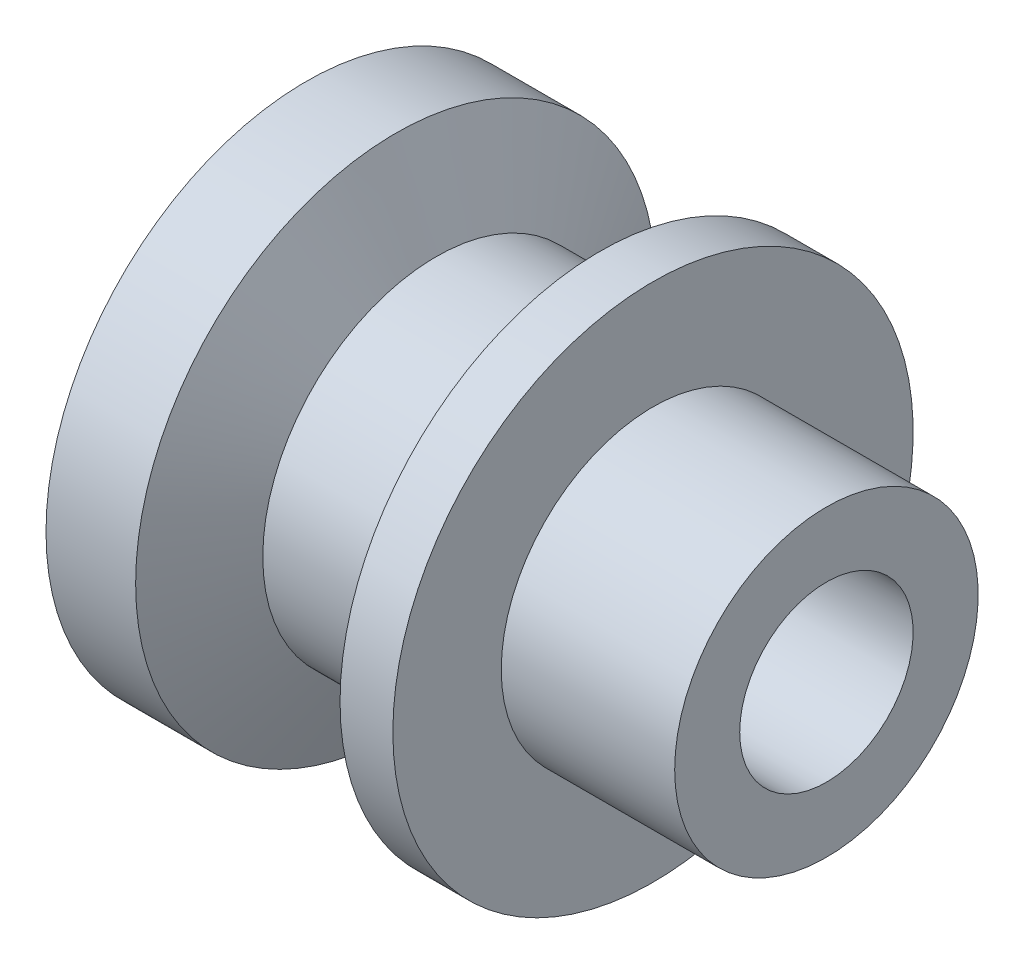
ISO-10303-21;
HEADER;
FILE_DESCRIPTION(('STEP AP214'),'2;1');
FILE_NAME('part.step','',(''),(''),'','','');
FILE_SCHEMA(('AUTOMOTIVE_DESIGN { 1 0 10303 214 1 1 1 1 }'));
ENDSEC;
DATA;
#1=APPLICATION_CONTEXT('core data for automotive mechanical design processes');
#2=APPLICATION_PROTOCOL_DEFINITION('international standard','automotive_design',2000,#1);
#3=PRODUCT_CONTEXT('',#1,'mechanical');
#4=PRODUCT('Part','Part','',(#3));
#5=PRODUCT_RELATED_PRODUCT_CATEGORY('part','',(#4));
#6=PRODUCT_DEFINITION_FORMATION('','',#4);
#7=PRODUCT_DEFINITION_CONTEXT('part definition',#1,'design');
#8=PRODUCT_DEFINITION('design','',#6,#7);
#9=PRODUCT_DEFINITION_SHAPE('','',#8);
#10=(LENGTH_UNIT() NAMED_UNIT(*) SI_UNIT(.MILLI.,.METRE.));
#11=(NAMED_UNIT(*) PLANE_ANGLE_UNIT() SI_UNIT($,.RADIAN.));
#12=(NAMED_UNIT(*) SI_UNIT($,.STERADIAN.) SOLID_ANGLE_UNIT());
#13=UNCERTAINTY_MEASURE_WITH_UNIT(LENGTH_MEASURE(1.E-05),#10,'distance_accuracy_value','');
#14=(GEOMETRIC_REPRESENTATION_CONTEXT(3) GLOBAL_UNCERTAINTY_ASSIGNED_CONTEXT((#13)) GLOBAL_UNIT_ASSIGNED_CONTEXT((#10,
#11,#12)) REPRESENTATION_CONTEXT('',''));
#15=CARTESIAN_POINT('',(0.,0.,0.));
#16=DIRECTION('',(0.,0.,1.));
#17=DIRECTION('',(1.,0.,0.));
#18=AXIS2_PLACEMENT_3D('',#15,#16,#17);
#19=CARTESIAN_POINT('',(-49.678120063437,0.,0.));
#20=DIRECTION('',(-1.,0.,0.));
#21=DIRECTION('',(0.,0.,1.));
#22=AXIS2_PLACEMENT_3D('',#19,#20,#21);
#23=CYLINDRICAL_SURFACE('',#22,60.);
#24=CARTESIAN_POINT('',(-52.1521396160569,0.,0.));
#25=DIRECTION('',(-1.,0.,0.));
#26=DIRECTION('',(0.,0.,1.));
#27=AXIS2_PLACEMENT_3D('',#24,#25,#26);
#28=CIRCLE('',#27,60.);
#29=CARTESIAN_POINT('',(-52.1521396160569,0.,60.));
#30=VERTEX_POINT('',#29);
#31=EDGE_CURVE('E10',#30,#30,#28,.T.);
#32=ORIENTED_EDGE('',*,*,#31,.F.);
#33=EDGE_LOOP('',(#32));
#34=FACE_BOUND('',#33,.T.);
#35=CARTESIAN_POINT('',(-31.4782927791567,0.,0.));
#36=DIRECTION('',(-1.,0.,0.));
#37=DIRECTION('',(0.,0.,1.));
#38=AXIS2_PLACEMENT_3D('',#35,#36,#37);
#39=CIRCLE('',#38,60.);
#40=CARTESIAN_POINT('',(-31.4782927791567,0.,60.));
#41=VERTEX_POINT('',#40);
#42=EDGE_CURVE('E80',#41,#41,#39,.T.);
#43=ORIENTED_EDGE('',*,*,#42,.T.);
#44=EDGE_LOOP('',(#43));
#45=FACE_BOUND('',#44,.T.);
#46=ADVANCED_FACE('F37',(#34,#45),#23,.T.);
#47=CARTESIAN_POINT('',(-52.1521396160569,60.,0.));
#48=DIRECTION('',(1.,0.,0.));
#49=DIRECTION('',(0.,0.,-1.));
#50=AXIS2_PLACEMENT_3D('',#47,#48,#49);
#51=PLANE('',#50);
#52=CARTESIAN_POINT('',(-52.1521396160569,0.,0.));
#53=DIRECTION('',(-1.,0.,0.));
#54=DIRECTION('',(0.,0.,1.));
#55=AXIS2_PLACEMENT_3D('',#52,#53,#54);
#56=CIRCLE('',#55,20.);
#57=CARTESIAN_POINT('',(-52.1521396160569,0.,20.));
#58=VERTEX_POINT('',#57);
#59=EDGE_CURVE('E44',#58,#58,#56,.T.);
#60=ORIENTED_EDGE('',*,*,#59,.F.);
#61=EDGE_LOOP('',(#60));
#62=FACE_BOUND('',#61,.T.);
#63=ORIENTED_EDGE('',*,*,#31,.T.);
#64=EDGE_LOOP('',(#63));
#65=FACE_BOUND('',#64,.T.);
#66=ADVANCED_FACE('F130',(#62,#65),#51,.F.);
#67=CARTESIAN_POINT('',(-49.678120063437,0.,0.));
#68=DIRECTION('',(-1.,0.,0.));
#69=DIRECTION('',(0.,0.,1.));
#70=AXIS2_PLACEMENT_3D('',#67,#68,#69);
#71=CYLINDRICAL_SURFACE('',#70,20.);
#72=CARTESIAN_POINT('',(67.8478603839431,0.,0.));
#73=DIRECTION('',(-1.,0.,0.));
#74=DIRECTION('',(0.,0.,1.));
#75=AXIS2_PLACEMENT_3D('',#72,#73,#74);
#76=CIRCLE('',#75,20.);
#77=CARTESIAN_POINT('',(67.8478603839431,0.,20.));
#78=VERTEX_POINT('',#77);
#79=EDGE_CURVE('E49',#78,#78,#76,.T.);
#80=ORIENTED_EDGE('',*,*,#79,.F.);
#81=EDGE_LOOP('',(#80));
#82=FACE_BOUND('',#81,.T.);
#83=ORIENTED_EDGE('',*,*,#59,.T.);
#84=EDGE_LOOP('',(#83));
#85=FACE_BOUND('',#84,.T.);
#86=ADVANCED_FACE('F125',(#82,#85),#71,.F.);
#87=CARTESIAN_POINT('',(67.8478603839431,20.,0.));
#88=DIRECTION('',(-1.,0.,0.));
#89=DIRECTION('',(0.,0.,1.));
#90=AXIS2_PLACEMENT_3D('',#87,#88,#89);
#91=PLANE('',#90);
#92=CARTESIAN_POINT('',(67.8478603839431,0.,0.));
#93=DIRECTION('',(-1.,0.,0.));
#94=DIRECTION('',(0.,0.,1.));
#95=AXIS2_PLACEMENT_3D('',#92,#93,#94);
#96=CIRCLE('',#95,35.);
#97=CARTESIAN_POINT('',(67.8478603839431,0.,35.));
#98=VERTEX_POINT('',#97);
#99=EDGE_CURVE('E54',#98,#98,#96,.T.);
#100=ORIENTED_EDGE('',*,*,#99,.F.);
#101=EDGE_LOOP('',(#100));
#102=FACE_BOUND('',#101,.T.);
#103=ORIENTED_EDGE('',*,*,#79,.T.);
#104=EDGE_LOOP('',(#103));
#105=FACE_BOUND('',#104,.T.);
#106=ADVANCED_FACE('F119',(#102,#105),#91,.F.);
#107=CARTESIAN_POINT('',(-49.678120063437,0.,0.));
#108=DIRECTION('',(-1.,0.,0.));
#109=DIRECTION('',(0.,0.,1.));
#110=AXIS2_PLACEMENT_3D('',#107,#108,#109);
#111=CYLINDRICAL_SURFACE('',#110,35.);
#112=CARTESIAN_POINT('',(27.8478603839431,0.,0.));
#113=DIRECTION('',(-1.,0.,0.));
#114=DIRECTION('',(0.,0.,1.));
#115=AXIS2_PLACEMENT_3D('',#112,#113,#114);
#116=CIRCLE('',#115,35.);
#117=CARTESIAN_POINT('',(27.8478603839431,0.,35.));
#118=VERTEX_POINT('',#117);
#119=EDGE_CURVE('E60',#118,#118,#116,.T.);
#120=ORIENTED_EDGE('',*,*,#119,.F.);
#121=EDGE_LOOP('',(#120));
#122=FACE_BOUND('',#121,.T.);
#123=ORIENTED_EDGE('',*,*,#99,.T.);
#124=EDGE_LOOP('',(#123));
#125=FACE_BOUND('',#124,.T.);
#126=ADVANCED_FACE('F113',(#122,#125),#111,.T.);
#127=CARTESIAN_POINT('',(27.8478603839431,35.,0.));
#128=DIRECTION('',(-1.,0.,0.));
#129=DIRECTION('',(0.,0.,1.));
#130=AXIS2_PLACEMENT_3D('',#127,#128,#129);
#131=PLANE('',#130);
#132=CARTESIAN_POINT('',(27.8478603839431,0.,0.));
#133=DIRECTION('',(-1.,0.,0.));
#134=DIRECTION('',(0.,0.,1.));
#135=AXIS2_PLACEMENT_3D('',#132,#133,#134);
#136=CIRCLE('',#135,60.);
#137=CARTESIAN_POINT('',(27.8478603839431,0.,60.));
#138=VERTEX_POINT('',#137);
#139=EDGE_CURVE('E64',#138,#138,#136,.T.);
#140=ORIENTED_EDGE('',*,*,#139,.F.);
#141=EDGE_LOOP('',(#140));
#142=FACE_BOUND('',#141,.T.);
#143=ORIENTED_EDGE('',*,*,#119,.T.);
#144=EDGE_LOOP('',(#143));
#145=FACE_BOUND('',#144,.T.);
#146=ADVANCED_FACE('F107',(#142,#145),#131,.F.);
#147=CARTESIAN_POINT('',(-49.678120063437,0.,0.));
#148=DIRECTION('',(-1.,0.,0.));
#149=DIRECTION('',(0.,0.,1.));
#150=AXIS2_PLACEMENT_3D('',#147,#148,#149);
#151=CYLINDRICAL_SURFACE('',#150,60.);
#152=CARTESIAN_POINT('',(15.6658765246025,0.,0.));
#153=DIRECTION('',(-1.,0.,0.));
#154=DIRECTION('',(0.,0.,1.));
#155=AXIS2_PLACEMENT_3D('',#152,#153,#154);
#156=CIRCLE('',#155,60.);
#157=CARTESIAN_POINT('',(15.6658765246025,0.,60.));
#158=VERTEX_POINT('',#157);
#159=EDGE_CURVE('E68',#158,#158,#156,.T.);
#160=ORIENTED_EDGE('',*,*,#159,.F.);
#161=EDGE_LOOP('',(#160));
#162=FACE_BOUND('',#161,.T.);
#163=ORIENTED_EDGE('',*,*,#139,.T.);
#164=EDGE_LOOP('',(#163));
#165=FACE_BOUND('',#164,.T.);
#166=ADVANCED_FACE('F101',(#162,#165),#151,.T.);
#167=CARTESIAN_POINT('',(15.6658765246025,0.,0.));
#168=DIRECTION('',(1.,0.,0.));
#169=DIRECTION('',(0.,0.,-1.));
#170=AXIS2_PLACEMENT_3D('',#167,#168,#169);
#171=CONICAL_SURFACE('',#170,60.,1.13446401379631);
#172=CARTESIAN_POINT('',(6.33972336150251,0.,0.));
#173=DIRECTION('',(-1.,0.,0.));
#174=DIRECTION('',(0.,0.,1.));
#175=AXIS2_PLACEMENT_3D('',#172,#173,#174);
#176=CIRCLE('',#175,40.);
#177=CARTESIAN_POINT('',(6.33972336150251,0.,40.));
#178=VERTEX_POINT('',#177);
#179=EDGE_CURVE('E72',#178,#178,#176,.T.);
#180=ORIENTED_EDGE('',*,*,#179,.F.);
#181=EDGE_LOOP('',(#180));
#182=FACE_BOUND('',#181,.T.);
#183=ORIENTED_EDGE('',*,*,#159,.T.);
#184=EDGE_LOOP('',(#183));
#185=FACE_BOUND('',#184,.T.);
#186=ADVANCED_FACE('F95',(#182,#185),#171,.T.);
#187=CARTESIAN_POINT('',(-49.678120063437,0.,0.));
#188=DIRECTION('',(-1.,0.,0.));
#189=DIRECTION('',(0.,0.,1.));
#190=AXIS2_PLACEMENT_3D('',#187,#188,#189);
#191=CYLINDRICAL_SURFACE('',#190,40.);
#192=CARTESIAN_POINT('',(-22.1521396160569,0.,0.));
#193=DIRECTION('',(-1.,0.,0.));
#194=DIRECTION('',(0.,0.,1.));
#195=AXIS2_PLACEMENT_3D('',#192,#193,#194);
#196=CIRCLE('',#195,40.);
#197=CARTESIAN_POINT('',(-22.1521396160569,0.,40.));
#198=VERTEX_POINT('',#197);
#199=EDGE_CURVE('E76',#198,#198,#196,.T.);
#200=ORIENTED_EDGE('',*,*,#199,.F.);
#201=EDGE_LOOP('',(#200));
#202=FACE_BOUND('',#201,.T.);
#203=ORIENTED_EDGE('',*,*,#179,.T.);
#204=EDGE_LOOP('',(#203));
#205=FACE_BOUND('',#204,.T.);
#206=ADVANCED_FACE('F89',(#202,#205),#191,.T.);
#207=CARTESIAN_POINT('',(-22.1521396160569,0.,0.));
#208=DIRECTION('',(-1.,0.,0.));
#209=DIRECTION('',(0.,0.,1.));
#210=AXIS2_PLACEMENT_3D('',#207,#208,#209);
#211=CONICAL_SURFACE('',#210,40.,1.13446401379632);
#212=ORIENTED_EDGE('',*,*,#42,.F.);
#213=EDGE_LOOP('',(#212));
#214=FACE_BOUND('',#213,.T.);
#215=ORIENTED_EDGE('',*,*,#199,.T.);
#216=EDGE_LOOP('',(#215));
#217=FACE_BOUND('',#216,.T.);
#218=ADVANCED_FACE('F86',(#214,#217),#211,.T.);
#219=CLOSED_SHELL('',(#46,#66,#86,#106,#126,#146,#166,#186,#206,#218));
#220=MANIFOLD_SOLID_BREP('B2',#219);
#221=ADVANCED_BREP_SHAPE_REPRESENTATION('',(#18,#220),#14);
#222=SHAPE_DEFINITION_REPRESENTATION(#9,#221);
ENDSEC;
END-ISO-10303-21;
